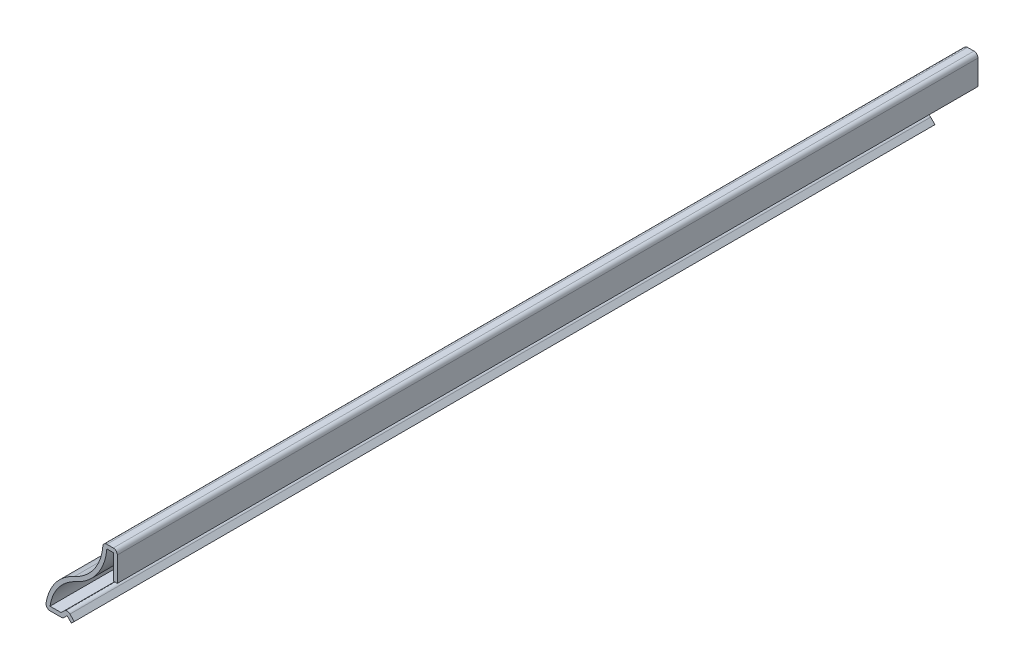
ISO-10303-21;
HEADER;
FILE_DESCRIPTION(('STEP AP214'),'2;1');
FILE_NAME('part.step','',(''),(''),'','','');
FILE_SCHEMA(('AUTOMOTIVE_DESIGN { 1 0 10303 214 1 1 1 1 }'));
ENDSEC;
DATA;
#1=APPLICATION_CONTEXT('core data for automotive mechanical design processes');
#2=APPLICATION_PROTOCOL_DEFINITION('international standard','automotive_design',2000,#1);
#3=PRODUCT_CONTEXT('',#1,'mechanical');
#4=PRODUCT('Part','Part','',(#3));
#5=PRODUCT_RELATED_PRODUCT_CATEGORY('part','',(#4));
#6=PRODUCT_DEFINITION_FORMATION('','',#4);
#7=PRODUCT_DEFINITION_CONTEXT('part definition',#1,'design');
#8=PRODUCT_DEFINITION('design','',#6,#7);
#9=PRODUCT_DEFINITION_SHAPE('','',#8);
#10=(LENGTH_UNIT() NAMED_UNIT(*) SI_UNIT(.MILLI.,.METRE.));
#11=(NAMED_UNIT(*) PLANE_ANGLE_UNIT() SI_UNIT($,.RADIAN.));
#12=(NAMED_UNIT(*) SI_UNIT($,.STERADIAN.) SOLID_ANGLE_UNIT());
#13=UNCERTAINTY_MEASURE_WITH_UNIT(LENGTH_MEASURE(1.E-05),#10,'distance_accuracy_value','');
#14=(GEOMETRIC_REPRESENTATION_CONTEXT(3) GLOBAL_UNCERTAINTY_ASSIGNED_CONTEXT((#13)) GLOBAL_UNIT_ASSIGNED_CONTEXT((#10,
#11,#12)) REPRESENTATION_CONTEXT('',''));
#15=CARTESIAN_POINT('',(0.,0.,0.));
#16=DIRECTION('',(0.,0.,1.));
#17=DIRECTION('',(1.,0.,0.));
#18=AXIS2_PLACEMENT_3D('',#15,#16,#17);
#19=CARTESIAN_POINT('',(0.,0.,-190.5));
#20=DIRECTION('',(0.707106781186547,-0.707106781186548,0.));
#21=DIRECTION('',(0.707106781186548,0.707106781186547,0.));
#22=AXIS2_PLACEMENT_3D('',#19,#20,#21);
#23=PLANE('',#22);
#24=DIRECTION('',(0.707106781186548,0.707106781186547,0.));
#25=VECTOR('',#24,1.);
#26=CARTESIAN_POINT('',(0.,0.,0.));
#27=LINE('',#26,#25);
#28=CARTESIAN_POINT('',(0.,0.,0.));
#29=VERTEX_POINT('',#28);
#30=CARTESIAN_POINT('',(0.628617928474841,0.62861792847484,0.));
#31=VERTEX_POINT('',#30);
#32=EDGE_CURVE('E246',#29,#31,#27,.T.);
#33=ORIENTED_EDGE('',*,*,#32,.F.);
#34=DIRECTION('',(0.,0.,1.));
#35=VECTOR('',#34,1.);
#36=CARTESIAN_POINT('',(0.,0.,-190.5));
#37=LINE('',#36,#35);
#38=CARTESIAN_POINT('',(0.,0.,-190.5));
#39=VERTEX_POINT('',#38);
#40=EDGE_CURVE('E205',#39,#29,#37,.T.);
#41=ORIENTED_EDGE('',*,*,#40,.F.);
#42=DIRECTION('',(0.707106781186548,0.707106781186547,0.));
#43=VECTOR('',#42,1.);
#44=CARTESIAN_POINT('',(0.,0.,-190.5));
#45=LINE('',#44,#43);
#46=CARTESIAN_POINT('',(0.628617928474841,0.62861792847484,-190.5));
#47=VERTEX_POINT('',#46);
#48=EDGE_CURVE('E199',#39,#47,#45,.T.);
#49=ORIENTED_EDGE('',*,*,#48,.T.);
#50=DIRECTION('',(0.,0.,1.));
#51=VECTOR('',#50,1.);
#52=CARTESIAN_POINT('',(0.628617928474841,0.62861792847484,-190.5));
#53=LINE('',#52,#51);
#54=EDGE_CURVE('E180',#47,#31,#53,.T.);
#55=ORIENTED_EDGE('',*,*,#54,.T.);
#56=EDGE_LOOP('',(#33,#41,#49,#55));
#57=FACE_BOUND('',#56,.T.);
#58=ADVANCED_FACE('F35',(#57),#23,.T.);
#59=CARTESIAN_POINT('',(0.,0.,-190.5));
#60=DIRECTION('',(-0.707106781186547,-0.707106781186548,0.));
#61=DIRECTION('',(0.707106781186548,-0.707106781186547,0.));
#62=AXIS2_PLACEMENT_3D('',#59,#60,#61);
#63=PLANE('',#62);
#64=DIRECTION('',(0.707106781186548,-0.707106781186547,0.));
#65=VECTOR('',#64,1.);
#66=CARTESIAN_POINT('',(0.,0.,0.));
#67=LINE('',#66,#65);
#68=CARTESIAN_POINT('',(-0.95888207152516,0.95888207152516,0.));
#69=VERTEX_POINT('',#68);
#70=EDGE_CURVE('E206',#69,#29,#67,.T.);
#71=ORIENTED_EDGE('',*,*,#70,.F.);
#72=DIRECTION('',(0.,0.,1.));
#73=VECTOR('',#72,1.);
#74=CARTESIAN_POINT('',(-0.95888207152516,0.95888207152516,-190.5));
#75=LINE('',#74,#73);
#76=CARTESIAN_POINT('',(-0.95888207152516,0.95888207152516,-190.5));
#77=VERTEX_POINT('',#76);
#78=EDGE_CURVE('E286',#77,#69,#75,.T.);
#79=ORIENTED_EDGE('',*,*,#78,.F.);
#80=DIRECTION('',(0.707106781186548,-0.707106781186547,0.));
#81=VECTOR('',#80,1.);
#82=CARTESIAN_POINT('',(0.,0.,-190.5));
#83=LINE('',#82,#81);
#84=EDGE_CURVE('E193',#77,#39,#83,.T.);
#85=ORIENTED_EDGE('',*,*,#84,.T.);
#86=ORIENTED_EDGE('',*,*,#40,.T.);
#87=EDGE_LOOP('',(#71,#79,#85,#86));
#88=FACE_BOUND('',#87,.T.);
#89=ADVANCED_FACE('F394',(#88),#63,.T.);
#90=CARTESIAN_POINT('',(-0.95888207152516,0.95888207152516,-190.5));
#91=DIRECTION('',(0.707106781186547,-0.707106781186548,0.));
#92=DIRECTION('',(0.707106781186548,0.707106781186547,0.));
#93=AXIS2_PLACEMENT_3D('',#90,#91,#92);
#94=PLANE('',#93);
#95=DIRECTION('',(0.707106781186548,0.707106781186547,0.));
#96=VECTOR('',#95,1.);
#97=CARTESIAN_POINT('',(-0.95888207152516,0.95888207152516,0.));
#98=LINE('',#97,#96);
#99=CARTESIAN_POINT('',(-1.65738207152516,0.260382071525159,0.));
#100=VERTEX_POINT('',#99);
#101=EDGE_CURVE('E209',#100,#69,#98,.T.);
#102=ORIENTED_EDGE('',*,*,#101,.F.);
#103=DIRECTION('',(0.,0.,1.));
#104=VECTOR('',#103,1.);
#105=CARTESIAN_POINT('',(-1.65738207152516,0.260382071525159,-190.5));
#106=LINE('',#105,#104);
#107=CARTESIAN_POINT('',(-1.65738207152516,0.260382071525159,-190.5));
#108=VERTEX_POINT('',#107);
#109=EDGE_CURVE('E331',#100,#108,#106,.F.);
#110=ORIENTED_EDGE('',*,*,#109,.T.);
#111=DIRECTION('',(0.707106781186548,0.707106781186547,0.));
#112=VECTOR('',#111,1.);
#113=CARTESIAN_POINT('',(-0.95888207152516,0.95888207152516,-190.5));
#114=LINE('',#113,#112);
#115=EDGE_CURVE('E243',#108,#77,#114,.T.);
#116=ORIENTED_EDGE('',*,*,#115,.T.);
#117=ORIENTED_EDGE('',*,*,#78,.T.);
#118=EDGE_LOOP('',(#102,#110,#116,#117));
#119=FACE_BOUND('',#118,.T.);
#120=ADVANCED_FACE('F421',(#119),#94,.T.);
#121=CARTESIAN_POINT('',(-1.91776414305032,0.,-190.5));
#122=DIRECTION('',(0.,-1.,0.));
#123=DIRECTION('',(1.,0.,0.));
#124=AXIS2_PLACEMENT_3D('',#121,#122,#123);
#125=PLANE('',#124);
#126=DIRECTION('',(1.,0.,0.));
#127=VECTOR('',#126,1.);
#128=CARTESIAN_POINT('',(-1.91776414305032,0.,-190.5));
#129=LINE('',#128,#127);
#130=CARTESIAN_POINT('',(-4.74271396986347,0.,-190.5));
#131=VERTEX_POINT('',#130);
#132=CARTESIAN_POINT('',(-2.286,0.,-190.5));
#133=VERTEX_POINT('',#132);
#134=EDGE_CURVE('E240',#131,#133,#129,.T.);
#135=ORIENTED_EDGE('',*,*,#134,.T.);
#136=DIRECTION('',(0.,0.,1.));
#137=VECTOR('',#136,1.);
#138=CARTESIAN_POINT('',(-2.286,0.,-190.5));
#139=LINE('',#138,#137);
#140=CARTESIAN_POINT('',(-2.286,0.,0.));
#141=VERTEX_POINT('',#140);
#142=EDGE_CURVE('E328',#133,#141,#139,.T.);
#143=ORIENTED_EDGE('',*,*,#142,.T.);
#144=DIRECTION('',(1.,0.,0.));
#145=VECTOR('',#144,1.);
#146=CARTESIAN_POINT('',(-1.91776414305032,0.,0.));
#147=LINE('',#146,#145);
#148=CARTESIAN_POINT('',(-4.74271396986347,0.,0.));
#149=VERTEX_POINT('',#148);
#150=EDGE_CURVE('E280',#149,#141,#147,.T.);
#151=ORIENTED_EDGE('',*,*,#150,.F.);
#152=DIRECTION('',(0.,0.,1.));
#153=VECTOR('',#152,1.);
#154=CARTESIAN_POINT('',(-4.74271396986347,0.,-190.5));
#155=LINE('',#154,#153);
#156=EDGE_CURVE('E326',#149,#131,#155,.F.);
#157=ORIENTED_EDGE('',*,*,#156,.T.);
#158=EDGE_LOOP('',(#135,#143,#151,#157));
#159=FACE_BOUND('',#158,.T.);
#160=ADVANCED_FACE('F405',(#159),#125,.T.);
#161=CARTESIAN_POINT('',(4.98123601312528,-0.527811779651085,-190.5));
#162=DIRECTION('',(0.,0.,1.));
#163=DIRECTION('',(1.,0.,0.));
#164=AXIS2_PLACEMENT_3D('',#161,#162,#163);
#165=CYLINDRICAL_SURFACE('',#164,10.715625);
#166=CARTESIAN_POINT('',(4.98123601312528,-0.527811779651085,-190.5));
#167=DIRECTION('',(0.,0.,1.));
#168=DIRECTION('',(-1.,0.,0.));
#169=AXIS2_PLACEMENT_3D('',#166,#167,#168);
#170=CIRCLE('',#169,10.715625);
#171=CARTESIAN_POINT('',(0.622114470800059,9.26109411017446,-190.5));
#172=VERTEX_POINT('',#171);
#173=CARTESIAN_POINT('',(-5.6224251153358,1.01717683305406,-190.5));
#174=VERTEX_POINT('',#173);
#175=EDGE_CURVE('E237',#172,#174,#170,.T.);
#176=ORIENTED_EDGE('',*,*,#175,.T.);
#177=DIRECTION('',(0.,0.,1.));
#178=VECTOR('',#177,1.);
#179=CARTESIAN_POINT('',(-5.6224251153358,1.01717683305406,-190.5));
#180=LINE('',#179,#178);
#181=CARTESIAN_POINT('',(-5.6224251153358,1.01717683305406,0.));
#182=VERTEX_POINT('',#181);
#183=EDGE_CURVE('E333',#174,#182,#180,.T.);
#184=ORIENTED_EDGE('',*,*,#183,.T.);
#185=CARTESIAN_POINT('',(4.98123601312528,-0.527811779651085,0.));
#186=DIRECTION('',(0.,0.,1.));
#187=DIRECTION('',(-1.,0.,0.));
#188=AXIS2_PLACEMENT_3D('',#185,#186,#187);
#189=CIRCLE('',#188,10.715625);
#190=CARTESIAN_POINT('',(0.622114470800059,9.26109411017446,0.));
#191=VERTEX_POINT('',#190);
#192=EDGE_CURVE('E277',#191,#182,#189,.T.);
#193=ORIENTED_EDGE('',*,*,#192,.F.);
#194=DIRECTION('',(0.,0.,1.));
#195=VECTOR('',#194,1.);
#196=CARTESIAN_POINT('',(0.622114470800059,9.26109411017446,-190.5));
#197=LINE('',#196,#195);
#198=EDGE_CURVE('E289',#172,#191,#197,.T.);
#199=ORIENTED_EDGE('',*,*,#198,.F.);
#200=EDGE_LOOP('',(#176,#184,#193,#199));
#201=FACE_BOUND('',#200,.T.);
#202=ADVANCED_FACE('F413',(#201),#165,.T.);
#203=CARTESIAN_POINT('',(-3.73700707152516,19.05,-190.5));
#204=DIRECTION('',(0.,0.,1.));
#205=DIRECTION('',(1.,0.,0.));
#206=AXIS2_PLACEMENT_3D('',#203,#204,#205);
#207=CYLINDRICAL_SURFACE('',#206,10.715625);
#208=CARTESIAN_POINT('',(-3.73700707152516,19.05,0.));
#209=DIRECTION('',(0.,0.,-1.));
#210=DIRECTION('',(1.,0.,0.));
#211=AXIS2_PLACEMENT_3D('',#208,#209,#210);
#212=CIRCLE('',#211,10.715625);
#213=CARTESIAN_POINT('',(6.94712830967935,18.2291039671683,0.));
#214=VERTEX_POINT('',#213);
#215=EDGE_CURVE('E275',#214,#191,#212,.T.);
#216=ORIENTED_EDGE('',*,*,#215,.F.);
#217=DIRECTION('',(0.,0.,1.));
#218=VECTOR('',#217,1.);
#219=CARTESIAN_POINT('',(6.94712830967935,18.2291039671683,-190.5));
#220=LINE('',#219,#218);
#221=CARTESIAN_POINT('',(6.94712830967935,18.2291039671683,-190.5));
#222=VERTEX_POINT('',#221);
#223=EDGE_CURVE('E43',#214,#222,#220,.F.);
#224=ORIENTED_EDGE('',*,*,#223,.T.);
#225=CARTESIAN_POINT('',(-3.73700707152516,19.05,-190.5));
#226=DIRECTION('',(0.,0.,-1.));
#227=DIRECTION('',(1.,0.,0.));
#228=AXIS2_PLACEMENT_3D('',#225,#226,#227);
#229=CIRCLE('',#228,10.715625);
#230=EDGE_CURVE('E235',#222,#172,#229,.T.);
#231=ORIENTED_EDGE('',*,*,#230,.T.);
#232=ORIENTED_EDGE('',*,*,#198,.T.);
#233=EDGE_LOOP('',(#216,#224,#231,#232));
#234=FACE_BOUND('',#233,.T.);
#235=ADVANCED_FACE('F343',(#234),#207,.F.);
#236=CARTESIAN_POINT('',(6.97861792847484,19.05,-190.5));
#237=DIRECTION('',(0.,1.,0.));
#238=DIRECTION('',(-1.,0.,0.));
#239=AXIS2_PLACEMENT_3D('',#236,#237,#238);
#240=PLANE('',#239);
#241=DIRECTION('',(-1.,0.,0.));
#242=VECTOR('',#241,1.);
#243=CARTESIAN_POINT('',(6.97861792847484,19.05,-190.5));
#244=LINE('',#243,#242);
#245=CARTESIAN_POINT('',(9.26461792847484,19.05,-190.5));
#246=VERTEX_POINT('',#245);
#247=CARTESIAN_POINT('',(7.8335158376015,19.05,-190.5));
#248=VERTEX_POINT('',#247);
#249=EDGE_CURVE('E233',#246,#248,#244,.T.);
#250=ORIENTED_EDGE('',*,*,#249,.T.);
#251=DIRECTION('',(0.,0.,1.));
#252=VECTOR('',#251,1.);
#253=CARTESIAN_POINT('',(7.8335158376015,19.05,-190.5));
#254=LINE('',#253,#252);
#255=CARTESIAN_POINT('',(7.8335158376015,19.05,0.));
#256=VERTEX_POINT('',#255);
#257=EDGE_CURVE('E338',#248,#256,#254,.T.);
#258=ORIENTED_EDGE('',*,*,#257,.T.);
#259=DIRECTION('',(-1.,0.,0.));
#260=VECTOR('',#259,1.);
#261=CARTESIAN_POINT('',(6.97861792847484,19.05,0.));
#262=LINE('',#261,#260);
#263=CARTESIAN_POINT('',(9.26461792847484,19.05,0.));
#264=VERTEX_POINT('',#263);
#265=EDGE_CURVE('E272',#264,#256,#262,.T.);
#266=ORIENTED_EDGE('',*,*,#265,.F.);
#267=DIRECTION('',(0.,0.,1.));
#268=VECTOR('',#267,1.);
#269=CARTESIAN_POINT('',(9.26461792847484,19.05,-190.5));
#270=LINE('',#269,#268);
#271=EDGE_CURVE('E336',#264,#246,#270,.F.);
#272=ORIENTED_EDGE('',*,*,#271,.T.);
#273=EDGE_LOOP('',(#250,#258,#266,#272));
#274=FACE_BOUND('',#273,.T.);
#275=ADVANCED_FACE('F351',(#274),#240,.T.);
#276=CARTESIAN_POINT('',(10.1536179284748,19.05,-190.5));
#277=DIRECTION('',(1.,0.,0.));
#278=DIRECTION('',(0.,1.,0.));
#279=AXIS2_PLACEMENT_3D('',#276,#277,#278);
#280=PLANE('',#279);
#281=DIRECTION('',(0.,1.,0.));
#282=VECTOR('',#281,1.);
#283=CARTESIAN_POINT('',(10.1536179284748,19.05,-190.5));
#284=LINE('',#283,#282);
#285=CARTESIAN_POINT('',(10.1536179284748,12.7,-190.5));
#286=VERTEX_POINT('',#285);
#287=CARTESIAN_POINT('',(10.1536179284748,18.161,-190.5));
#288=VERTEX_POINT('',#287);
#289=EDGE_CURVE('E231',#286,#288,#284,.T.);
#290=ORIENTED_EDGE('',*,*,#289,.T.);
#291=DIRECTION('',(0.,0.,1.));
#292=VECTOR('',#291,1.);
#293=CARTESIAN_POINT('',(10.1536179284748,18.161,-190.5));
#294=LINE('',#293,#292);
#295=CARTESIAN_POINT('',(10.1536179284748,18.161,0.));
#296=VERTEX_POINT('',#295);
#297=EDGE_CURVE('E11',#288,#296,#294,.T.);
#298=ORIENTED_EDGE('',*,*,#297,.T.);
#299=DIRECTION('',(0.,1.,0.));
#300=VECTOR('',#299,1.);
#301=CARTESIAN_POINT('',(10.1536179284748,19.05,0.));
#302=LINE('',#301,#300);
#303=CARTESIAN_POINT('',(10.1536179284748,12.7,0.));
#304=VERTEX_POINT('',#303);
#305=EDGE_CURVE('E269',#304,#296,#302,.T.);
#306=ORIENTED_EDGE('',*,*,#305,.F.);
#307=DIRECTION('',(0.,0.,1.));
#308=VECTOR('',#307,1.);
#309=CARTESIAN_POINT('',(10.1536179284748,12.7,-190.5));
#310=LINE('',#309,#308);
#311=EDGE_CURVE('E292',#286,#304,#310,.T.);
#312=ORIENTED_EDGE('',*,*,#311,.F.);
#313=EDGE_LOOP('',(#290,#298,#306,#312));
#314=FACE_BOUND('',#313,.T.);
#315=ADVANCED_FACE('F359',(#314),#280,.T.);
#316=CARTESIAN_POINT('',(9.26461792847484,12.7,-190.5));
#317=DIRECTION('',(0.,-1.,0.));
#318=DIRECTION('',(0.,0.,-1.));
#319=AXIS2_PLACEMENT_3D('',#316,#317,#318);
#320=PLANE('',#319);
#321=DIRECTION('',(1.,0.,0.));
#322=VECTOR('',#321,1.);
#323=CARTESIAN_POINT('',(9.26461792847484,12.7,0.));
#324=LINE('',#323,#322);
#325=CARTESIAN_POINT('',(9.26461792847484,12.7,0.));
#326=VERTEX_POINT('',#325);
#327=EDGE_CURVE('E266',#326,#304,#324,.T.);
#328=ORIENTED_EDGE('',*,*,#327,.F.);
#329=DIRECTION('',(0.,0.,1.));
#330=VECTOR('',#329,1.);
#331=CARTESIAN_POINT('',(9.26461792847484,12.7,-190.5));
#332=LINE('',#331,#330);
#333=CARTESIAN_POINT('',(9.26461792847484,12.7,-190.5));
#334=VERTEX_POINT('',#333);
#335=EDGE_CURVE('E294',#334,#326,#332,.T.);
#336=ORIENTED_EDGE('',*,*,#335,.F.);
#337=DIRECTION('',(1.,0.,0.));
#338=VECTOR('',#337,1.);
#339=CARTESIAN_POINT('',(9.26461792847484,12.7,-190.5));
#340=LINE('',#339,#338);
#341=EDGE_CURVE('E228',#334,#286,#340,.T.);
#342=ORIENTED_EDGE('',*,*,#341,.T.);
#343=ORIENTED_EDGE('',*,*,#311,.T.);
#344=EDGE_LOOP('',(#328,#336,#342,#343));
#345=FACE_BOUND('',#344,.T.);
#346=ADVANCED_FACE('F364',(#345),#320,.T.);
#347=CARTESIAN_POINT('',(9.26461792847484,18.161,-190.5));
#348=DIRECTION('',(-1.,0.,0.));
#349=DIRECTION('',(0.,0.,1.));
#350=AXIS2_PLACEMENT_3D('',#347,#348,#349);
#351=PLANE('',#350);
#352=DIRECTION('',(0.,-1.,0.));
#353=VECTOR('',#352,1.);
#354=CARTESIAN_POINT('',(9.26461792847484,18.161,0.));
#355=LINE('',#354,#353);
#356=CARTESIAN_POINT('',(9.26461792847484,18.161,0.));
#357=VERTEX_POINT('',#356);
#358=EDGE_CURVE('E263',#357,#326,#355,.T.);
#359=ORIENTED_EDGE('',*,*,#358,.F.);
#360=DIRECTION('',(0.,0.,1.));
#361=VECTOR('',#360,1.);
#362=CARTESIAN_POINT('',(9.26461792847484,18.161,-190.5));
#363=LINE('',#362,#361);
#364=CARTESIAN_POINT('',(9.26461792847484,18.161,-190.5));
#365=VERTEX_POINT('',#364);
#366=EDGE_CURVE('E296',#365,#357,#363,.T.);
#367=ORIENTED_EDGE('',*,*,#366,.F.);
#368=DIRECTION('',(0.,-1.,0.));
#369=VECTOR('',#368,1.);
#370=CARTESIAN_POINT('',(9.26461792847484,18.161,-190.5));
#371=LINE('',#370,#369);
#372=EDGE_CURVE('E225',#365,#334,#371,.T.);
#373=ORIENTED_EDGE('',*,*,#372,.T.);
#374=ORIENTED_EDGE('',*,*,#335,.T.);
#375=EDGE_LOOP('',(#359,#367,#373,#374));
#376=FACE_BOUND('',#375,.T.);
#377=ADVANCED_FACE('F367',(#376),#351,.T.);
#378=CARTESIAN_POINT('',(7.8335158376015,18.161,-190.5));
#379=DIRECTION('',(0.,-1.,0.));
#380=DIRECTION('',(0.,0.,-1.));
#381=AXIS2_PLACEMENT_3D('',#378,#379,#380);
#382=PLANE('',#381);
#383=DIRECTION('',(1.,0.,0.));
#384=VECTOR('',#383,1.);
#385=CARTESIAN_POINT('',(7.8335158376015,18.161,0.));
#386=LINE('',#385,#384);
#387=CARTESIAN_POINT('',(7.8335158376015,18.161,0.));
#388=VERTEX_POINT('',#387);
#389=EDGE_CURVE('E260',#388,#357,#386,.T.);
#390=ORIENTED_EDGE('',*,*,#389,.F.);
#391=DIRECTION('',(0.,0.,1.));
#392=VECTOR('',#391,1.);
#393=CARTESIAN_POINT('',(7.8335158376015,18.161,-190.5));
#394=LINE('',#393,#392);
#395=CARTESIAN_POINT('',(7.8335158376015,18.161,-190.5));
#396=VERTEX_POINT('',#395);
#397=EDGE_CURVE('E298',#396,#388,#394,.T.);
#398=ORIENTED_EDGE('',*,*,#397,.F.);
#399=DIRECTION('',(1.,0.,0.));
#400=VECTOR('',#399,1.);
#401=CARTESIAN_POINT('',(7.8335158376015,18.161,-190.5));
#402=LINE('',#401,#400);
#403=EDGE_CURVE('E222',#396,#365,#402,.T.);
#404=ORIENTED_EDGE('',*,*,#403,.T.);
#405=ORIENTED_EDGE('',*,*,#366,.T.);
#406=EDGE_LOOP('',(#390,#398,#404,#405));
#407=FACE_BOUND('',#406,.T.);
#408=ADVANCED_FACE('F372',(#407),#382,.T.);
#409=CARTESIAN_POINT('',(-3.73700707152516,19.05,-190.5));
#410=DIRECTION('',(0.,0.,1.));
#411=DIRECTION('',(1.,0.,0.));
#412=AXIS2_PLACEMENT_3D('',#409,#410,#411);
#413=CYLINDRICAL_SURFACE('',#412,11.604625);
#414=CARTESIAN_POINT('',(-3.73700707152516,19.05,0.));
#415=DIRECTION('',(0.,0.,1.));
#416=DIRECTION('',(1.,0.,0.));
#417=AXIS2_PLACEMENT_3D('',#414,#415,#416);
#418=CIRCLE('',#417,11.604625);
#419=CARTESIAN_POINT('',(0.983760109867035,8.44897747338893,0.));
#420=VERTEX_POINT('',#419);
#421=EDGE_CURVE('E257',#420,#388,#418,.T.);
#422=ORIENTED_EDGE('',*,*,#421,.F.);
#423=DIRECTION('',(0.,0.,1.));
#424=VECTOR('',#423,1.);
#425=CARTESIAN_POINT('',(0.983760109867035,8.44897747338893,-190.5));
#426=LINE('',#425,#424);
#427=CARTESIAN_POINT('',(0.983760109867035,8.44897747338893,-190.5));
#428=VERTEX_POINT('',#427);
#429=EDGE_CURVE('E300',#428,#420,#426,.T.);
#430=ORIENTED_EDGE('',*,*,#429,.F.);
#431=CARTESIAN_POINT('',(-3.73700707152516,19.05,-190.5));
#432=DIRECTION('',(0.,0.,1.));
#433=DIRECTION('',(1.,0.,0.));
#434=AXIS2_PLACEMENT_3D('',#431,#432,#433);
#435=CIRCLE('',#434,11.604625);
#436=EDGE_CURVE('E219',#428,#396,#435,.T.);
#437=ORIENTED_EDGE('',*,*,#436,.T.);
#438=ORIENTED_EDGE('',*,*,#397,.T.);
#439=EDGE_LOOP('',(#422,#430,#437,#438));
#440=FACE_BOUND('',#439,.T.);
#441=ADVANCED_FACE('F375',(#440),#413,.T.);
#442=CARTESIAN_POINT('',(4.98123601312528,-0.527811779651085,-190.5));
#443=DIRECTION('',(0.,0.,1.));
#444=DIRECTION('',(1.,0.,0.));
#445=AXIS2_PLACEMENT_3D('',#442,#443,#444);
#446=CYLINDRICAL_SURFACE('',#445,9.826625);
#447=CARTESIAN_POINT('',(4.98123601312528,-0.527811779651085,0.));
#448=DIRECTION('',(0.,0.,-1.));
#449=DIRECTION('',(-1.,0.,0.));
#450=AXIS2_PLACEMENT_3D('',#447,#448,#449);
#451=CIRCLE('',#450,9.826625);
#452=CARTESIAN_POINT('',(-4.74271396986347,0.889,0.));
#453=VERTEX_POINT('',#452);
#454=EDGE_CURVE('E254',#453,#420,#451,.T.);
#455=ORIENTED_EDGE('',*,*,#454,.F.);
#456=DIRECTION('',(0.,0.,1.));
#457=VECTOR('',#456,1.);
#458=CARTESIAN_POINT('',(-4.74271396986347,0.889,-190.5));
#459=LINE('',#458,#457);
#460=CARTESIAN_POINT('',(-4.74271396986347,0.889,-190.5));
#461=VERTEX_POINT('',#460);
#462=EDGE_CURVE('E302',#461,#453,#459,.T.);
#463=ORIENTED_EDGE('',*,*,#462,.F.);
#464=CARTESIAN_POINT('',(4.98123601312528,-0.527811779651085,-190.5));
#465=DIRECTION('',(0.,0.,-1.));
#466=DIRECTION('',(-1.,0.,0.));
#467=AXIS2_PLACEMENT_3D('',#464,#465,#466);
#468=CIRCLE('',#467,9.826625);
#469=EDGE_CURVE('E216',#461,#428,#468,.T.);
#470=ORIENTED_EDGE('',*,*,#469,.T.);
#471=ORIENTED_EDGE('',*,*,#429,.T.);
#472=EDGE_LOOP('',(#455,#463,#470,#471));
#473=FACE_BOUND('',#472,.T.);
#474=ADVANCED_FACE('F380',(#473),#446,.F.);
#475=CARTESIAN_POINT('',(-2.286,0.889,-190.5));
#476=DIRECTION('',(0.,1.,0.));
#477=DIRECTION('',(-1.,0.,0.));
#478=AXIS2_PLACEMENT_3D('',#475,#476,#477);
#479=PLANE('',#478);
#480=DIRECTION('',(-1.,0.,0.));
#481=VECTOR('',#480,1.);
#482=CARTESIAN_POINT('',(-2.286,0.889,0.));
#483=LINE('',#482,#481);
#484=CARTESIAN_POINT('',(-2.286,0.889,0.));
#485=VERTEX_POINT('',#484);
#486=EDGE_CURVE('E251',#485,#453,#483,.T.);
#487=ORIENTED_EDGE('',*,*,#486,.F.);
#488=DIRECTION('',(0.,0.,1.));
#489=VECTOR('',#488,1.);
#490=CARTESIAN_POINT('',(-2.286,0.889,-190.5));
#491=LINE('',#490,#489);
#492=CARTESIAN_POINT('',(-2.286,0.889,-190.5));
#493=VERTEX_POINT('',#492);
#494=EDGE_CURVE('E192',#493,#485,#491,.T.);
#495=ORIENTED_EDGE('',*,*,#494,.F.);
#496=DIRECTION('',(-1.,0.,0.));
#497=VECTOR('',#496,1.);
#498=CARTESIAN_POINT('',(-2.286,0.889,-190.5));
#499=LINE('',#498,#497);
#500=EDGE_CURVE('E213',#493,#461,#499,.T.);
#501=ORIENTED_EDGE('',*,*,#500,.T.);
#502=ORIENTED_EDGE('',*,*,#462,.T.);
#503=EDGE_LOOP('',(#487,#495,#501,#502));
#504=FACE_BOUND('',#503,.T.);
#505=ADVANCED_FACE('F383',(#504),#479,.T.);
#506=CARTESIAN_POINT('',(-0.95888207152516,2.21611792847484,-190.5));
#507=DIRECTION('',(-0.707106781186548,0.707106781186548,0.));
#508=DIRECTION('',(-0.707106781186548,-0.707106781186548,0.));
#509=AXIS2_PLACEMENT_3D('',#506,#507,#508);
#510=PLANE('',#509);
#511=DIRECTION('',(-0.707106781186547,-0.707106781186547,0.));
#512=VECTOR('',#511,1.);
#513=CARTESIAN_POINT('',(-0.95888207152516,2.21611792847484,0.));
#514=LINE('',#513,#512);
#515=CARTESIAN_POINT('',(-1.5875,1.5875,0.));
#516=VERTEX_POINT('',#515);
#517=EDGE_CURVE('E249',#516,#485,#514,.T.);
#518=ORIENTED_EDGE('',*,*,#517,.F.);
#519=DIRECTION('',(0.,0.,1.));
#520=VECTOR('',#519,1.);
#521=CARTESIAN_POINT('',(-1.5875,1.5875,-190.5));
#522=LINE('',#521,#520);
#523=CARTESIAN_POINT('',(-1.5875,1.5875,-190.5));
#524=VERTEX_POINT('',#523);
#525=EDGE_CURVE('E317',#516,#524,#522,.F.);
#526=ORIENTED_EDGE('',*,*,#525,.T.);
#527=DIRECTION('',(-0.707106781186547,-0.707106781186547,0.));
#528=VECTOR('',#527,1.);
#529=CARTESIAN_POINT('',(-0.95888207152516,2.21611792847484,-190.5));
#530=LINE('',#529,#528);
#531=EDGE_CURVE('E203',#524,#493,#530,.T.);
#532=ORIENTED_EDGE('',*,*,#531,.T.);
#533=ORIENTED_EDGE('',*,*,#494,.T.);
#534=EDGE_LOOP('',(#518,#526,#532,#533));
#535=FACE_BOUND('',#534,.T.);
#536=ADVANCED_FACE('F491',(#535),#510,.T.);
#537=CARTESIAN_POINT('',(0.628617928474841,0.62861792847484,-190.5));
#538=DIRECTION('',(0.707106781186548,0.707106781186547,0.));
#539=DIRECTION('',(-0.707106781186547,0.707106781186548,0.));
#540=AXIS2_PLACEMENT_3D('',#537,#538,#539);
#541=PLANE('',#540);
#542=DIRECTION('',(-0.707106781186547,0.707106781186548,0.));
#543=VECTOR('',#542,1.);
#544=CARTESIAN_POINT('',(0.628617928474841,0.62861792847484,-190.5));
#545=LINE('',#544,#543);
#546=CARTESIAN_POINT('',(-0.330264143050319,1.5875,-190.5));
#547=VERTEX_POINT('',#546);
#548=EDGE_CURVE('E184',#47,#547,#545,.T.);
#549=ORIENTED_EDGE('',*,*,#548,.T.);
#550=DIRECTION('',(0.,0.,1.));
#551=VECTOR('',#550,1.);
#552=CARTESIAN_POINT('',(-0.330264143050319,1.5875,-190.5));
#553=LINE('',#552,#551);
#554=CARTESIAN_POINT('',(-0.330264143050319,1.5875,0.));
#555=VERTEX_POINT('',#554);
#556=EDGE_CURVE('E285',#547,#555,#553,.T.);
#557=ORIENTED_EDGE('',*,*,#556,.T.);
#558=DIRECTION('',(-0.707106781186547,0.707106781186548,0.));
#559=VECTOR('',#558,1.);
#560=CARTESIAN_POINT('',(0.628617928474841,0.62861792847484,0.));
#561=LINE('',#560,#559);
#562=EDGE_CURVE('E187',#31,#555,#561,.T.);
#563=ORIENTED_EDGE('',*,*,#562,.F.);
#564=ORIENTED_EDGE('',*,*,#54,.F.);
#565=EDGE_LOOP('',(#549,#557,#563,#564));
#566=FACE_BOUND('',#565,.T.);
#567=ADVANCED_FACE('F182',(#566),#541,.T.);
#568=CARTESIAN_POINT('',(4.98123601312528,-0.527811779651085,-190.5));
#569=DIRECTION('',(0.,0.,-1.));
#570=DIRECTION('',(-1.,0.,0.));
#571=AXIS2_PLACEMENT_3D('',#568,#569,#570);
#572=PLANE('',#571);
#573=ORIENTED_EDGE('',*,*,#531,.F.);
#574=CARTESIAN_POINT('',(-0.95888207152516,0.95888207152516,-190.5));
#575=DIRECTION('',(0.,0.,-1.));
#576=DIRECTION('',(-1.,0.,0.));
#577=AXIS2_PLACEMENT_3D('',#574,#575,#576);
#578=CIRCLE('',#577,0.889);
#579=EDGE_CURVE('E202',#524,#547,#578,.T.);
#580=ORIENTED_EDGE('',*,*,#579,.T.);
#581=ORIENTED_EDGE('',*,*,#548,.F.);
#582=ORIENTED_EDGE('',*,*,#48,.F.);
#583=ORIENTED_EDGE('',*,*,#84,.F.);
#584=ORIENTED_EDGE('',*,*,#115,.F.);
#585=CARTESIAN_POINT('',(-2.286,0.889,-190.5));
#586=DIRECTION('',(0.,0.,-1.));
#587=DIRECTION('',(-1.,0.,0.));
#588=AXIS2_PLACEMENT_3D('',#585,#586,#587);
#589=CIRCLE('',#588,0.889);
#590=EDGE_CURVE('E323',#108,#133,#589,.T.);
#591=ORIENTED_EDGE('',*,*,#590,.T.);
#592=ORIENTED_EDGE('',*,*,#134,.F.);
#593=CARTESIAN_POINT('',(-4.74271396986347,0.889,-190.5));
#594=DIRECTION('',(0.,0.,-1.));
#595=DIRECTION('',(-1.,0.,0.));
#596=AXIS2_PLACEMENT_3D('',#593,#594,#595);
#597=CIRCLE('',#596,0.889);
#598=EDGE_CURVE('E321',#131,#174,#597,.T.);
#599=ORIENTED_EDGE('',*,*,#598,.T.);
#600=ORIENTED_EDGE('',*,*,#175,.F.);
#601=ORIENTED_EDGE('',*,*,#230,.F.);
#602=CARTESIAN_POINT('',(7.8335158376015,18.161,-190.5));
#603=DIRECTION('',(0.,0.,-1.));
#604=DIRECTION('',(-1.,0.,0.));
#605=AXIS2_PLACEMENT_3D('',#602,#603,#604);
#606=CIRCLE('',#605,0.889);
#607=EDGE_CURVE('E56',#222,#248,#606,.T.);
#608=ORIENTED_EDGE('',*,*,#607,.T.);
#609=ORIENTED_EDGE('',*,*,#249,.F.);
#610=CARTESIAN_POINT('',(9.26461792847484,18.161,-190.5));
#611=DIRECTION('',(0.,0.,-1.));
#612=DIRECTION('',(-1.,0.,0.));
#613=AXIS2_PLACEMENT_3D('',#610,#611,#612);
#614=CIRCLE('',#613,0.889);
#615=EDGE_CURVE('E50',#246,#288,#614,.T.);
#616=ORIENTED_EDGE('',*,*,#615,.T.);
#617=ORIENTED_EDGE('',*,*,#289,.F.);
#618=ORIENTED_EDGE('',*,*,#341,.F.);
#619=ORIENTED_EDGE('',*,*,#372,.F.);
#620=ORIENTED_EDGE('',*,*,#403,.F.);
#621=ORIENTED_EDGE('',*,*,#436,.F.);
#622=ORIENTED_EDGE('',*,*,#469,.F.);
#623=ORIENTED_EDGE('',*,*,#500,.F.);
#624=EDGE_LOOP('',(#573,#580,#581,#582,#583,#584,#591,#592,#599,#600,#601,#608,#609,#616,#617,
#618,#619,#620,#621,#622,#623));
#625=FACE_BOUND('',#624,.T.);
#626=ADVANCED_FACE('F197',(#625),#572,.T.);
#627=CARTESIAN_POINT('',(4.98123601312528,-0.527811779651085,0.));
#628=DIRECTION('',(0.,0.,-1.));
#629=DIRECTION('',(-1.,0.,0.));
#630=AXIS2_PLACEMENT_3D('',#627,#628,#629);
#631=PLANE('',#630);
#632=ORIENTED_EDGE('',*,*,#562,.T.);
#633=CARTESIAN_POINT('',(-0.95888207152516,0.95888207152516,0.));
#634=DIRECTION('',(0.,0.,-1.));
#635=DIRECTION('',(-1.,0.,0.));
#636=AXIS2_PLACEMENT_3D('',#633,#634,#635);
#637=CIRCLE('',#636,0.889);
#638=EDGE_CURVE('E315',#555,#516,#637,.F.);
#639=ORIENTED_EDGE('',*,*,#638,.T.);
#640=ORIENTED_EDGE('',*,*,#517,.T.);
#641=ORIENTED_EDGE('',*,*,#486,.T.);
#642=ORIENTED_EDGE('',*,*,#454,.T.);
#643=ORIENTED_EDGE('',*,*,#421,.T.);
#644=ORIENTED_EDGE('',*,*,#389,.T.);
#645=ORIENTED_EDGE('',*,*,#358,.T.);
#646=ORIENTED_EDGE('',*,*,#327,.T.);
#647=ORIENTED_EDGE('',*,*,#305,.T.);
#648=CARTESIAN_POINT('',(9.26461792847484,18.161,0.));
#649=DIRECTION('',(0.,0.,-1.));
#650=DIRECTION('',(-1.,0.,0.));
#651=AXIS2_PLACEMENT_3D('',#648,#649,#650);
#652=CIRCLE('',#651,0.889);
#653=EDGE_CURVE('E307',#296,#264,#652,.F.);
#654=ORIENTED_EDGE('',*,*,#653,.T.);
#655=ORIENTED_EDGE('',*,*,#265,.T.);
#656=CARTESIAN_POINT('',(7.8335158376015,18.161,0.));
#657=DIRECTION('',(0.,0.,-1.));
#658=DIRECTION('',(-1.,0.,0.));
#659=AXIS2_PLACEMENT_3D('',#656,#657,#658);
#660=CIRCLE('',#659,0.889);
#661=EDGE_CURVE('E309',#256,#214,#660,.F.);
#662=ORIENTED_EDGE('',*,*,#661,.T.);
#663=ORIENTED_EDGE('',*,*,#215,.T.);
#664=ORIENTED_EDGE('',*,*,#192,.T.);
#665=CARTESIAN_POINT('',(-4.74271396986347,0.889,0.));
#666=DIRECTION('',(0.,0.,-1.));
#667=DIRECTION('',(-1.,0.,0.));
#668=AXIS2_PLACEMENT_3D('',#665,#666,#667);
#669=CIRCLE('',#668,0.889);
#670=EDGE_CURVE('E311',#182,#149,#669,.F.);
#671=ORIENTED_EDGE('',*,*,#670,.T.);
#672=ORIENTED_EDGE('',*,*,#150,.T.);
#673=CARTESIAN_POINT('',(-2.286,0.889,0.));
#674=DIRECTION('',(0.,0.,-1.));
#675=DIRECTION('',(-1.,0.,0.));
#676=AXIS2_PLACEMENT_3D('',#673,#674,#675);
#677=CIRCLE('',#676,0.889);
#678=EDGE_CURVE('E313',#141,#100,#677,.F.);
#679=ORIENTED_EDGE('',*,*,#678,.T.);
#680=ORIENTED_EDGE('',*,*,#101,.T.);
#681=ORIENTED_EDGE('',*,*,#70,.T.);
#682=ORIENTED_EDGE('',*,*,#32,.T.);
#683=EDGE_LOOP('',(#632,#639,#640,#641,#642,#643,#644,#645,#646,#647,#654,#655,#662,#663,#664,
#671,#672,#679,#680,#681,#682));
#684=FACE_BOUND('',#683,.T.);
#685=ADVANCED_FACE('F354',(#684),#631,.F.);
#686=CARTESIAN_POINT('',(-0.95888207152516,0.95888207152516,-190.5));
#687=DIRECTION('',(0.,0.,1.));
#688=DIRECTION('',(1.,0.,0.));
#689=AXIS2_PLACEMENT_3D('',#686,#687,#688);
#690=CYLINDRICAL_SURFACE('',#689,0.889);
#691=ORIENTED_EDGE('',*,*,#579,.F.);
#692=ORIENTED_EDGE('',*,*,#525,.F.);
#693=ORIENTED_EDGE('',*,*,#638,.F.);
#694=ORIENTED_EDGE('',*,*,#556,.F.);
#695=EDGE_LOOP('',(#691,#692,#693,#694));
#696=FACE_BOUND('',#695,.T.);
#697=ADVANCED_FACE('F388',(#696),#690,.T.);
#698=CARTESIAN_POINT('',(-2.286,0.889,-190.5));
#699=DIRECTION('',(0.,0.,1.));
#700=DIRECTION('',(1.,0.,0.));
#701=AXIS2_PLACEMENT_3D('',#698,#699,#700);
#702=CYLINDRICAL_SURFACE('',#701,0.889);
#703=ORIENTED_EDGE('',*,*,#590,.F.);
#704=ORIENTED_EDGE('',*,*,#109,.F.);
#705=ORIENTED_EDGE('',*,*,#678,.F.);
#706=ORIENTED_EDGE('',*,*,#142,.F.);
#707=EDGE_LOOP('',(#703,#704,#705,#706));
#708=FACE_BOUND('',#707,.T.);
#709=ADVANCED_FACE('F402',(#708),#702,.T.);
#710=CARTESIAN_POINT('',(-4.74271396986347,0.889,-190.5));
#711=DIRECTION('',(0.,0.,1.));
#712=DIRECTION('',(1.,0.,0.));
#713=AXIS2_PLACEMENT_3D('',#710,#711,#712);
#714=CYLINDRICAL_SURFACE('',#713,0.889);
#715=ORIENTED_EDGE('',*,*,#598,.F.);
#716=ORIENTED_EDGE('',*,*,#156,.F.);
#717=ORIENTED_EDGE('',*,*,#670,.F.);
#718=ORIENTED_EDGE('',*,*,#183,.F.);
#719=EDGE_LOOP('',(#715,#716,#717,#718));
#720=FACE_BOUND('',#719,.T.);
#721=ADVANCED_FACE('F411',(#720),#714,.T.);
#722=CARTESIAN_POINT('',(7.8335158376015,18.161,-190.5));
#723=DIRECTION('',(0.,0.,1.));
#724=DIRECTION('',(1.,0.,0.));
#725=AXIS2_PLACEMENT_3D('',#722,#723,#724);
#726=CYLINDRICAL_SURFACE('',#725,0.889);
#727=ORIENTED_EDGE('',*,*,#607,.F.);
#728=ORIENTED_EDGE('',*,*,#223,.F.);
#729=ORIENTED_EDGE('',*,*,#661,.F.);
#730=ORIENTED_EDGE('',*,*,#257,.F.);
#731=EDGE_LOOP('',(#727,#728,#729,#730));
#732=FACE_BOUND('',#731,.T.);
#733=ADVANCED_FACE('F348',(#732),#726,.T.);
#734=CARTESIAN_POINT('',(9.26461792847484,18.161,-190.5));
#735=DIRECTION('',(0.,0.,1.));
#736=DIRECTION('',(1.,0.,0.));
#737=AXIS2_PLACEMENT_3D('',#734,#735,#736);
#738=CYLINDRICAL_SURFACE('',#737,0.889);
#739=ORIENTED_EDGE('',*,*,#615,.F.);
#740=ORIENTED_EDGE('',*,*,#271,.F.);
#741=ORIENTED_EDGE('',*,*,#653,.F.);
#742=ORIENTED_EDGE('',*,*,#297,.F.);
#743=EDGE_LOOP('',(#739,#740,#741,#742));
#744=FACE_BOUND('',#743,.T.);
#745=ADVANCED_FACE('F37',(#744),#738,.T.);
#746=CLOSED_SHELL('',(#58,#89,#120,#160,#202,#235,#275,#315,#346,#377,#408,#441,#474,#505,#536,
#567,#626,#685,#697,#709,#721,#733,#745));
#747=MANIFOLD_SOLID_BREP('B2',#746);
#748=ADVANCED_BREP_SHAPE_REPRESENTATION('',(#18,#747),#14);
#749=SHAPE_DEFINITION_REPRESENTATION(#9,#748);
ENDSEC;
END-ISO-10303-21;
